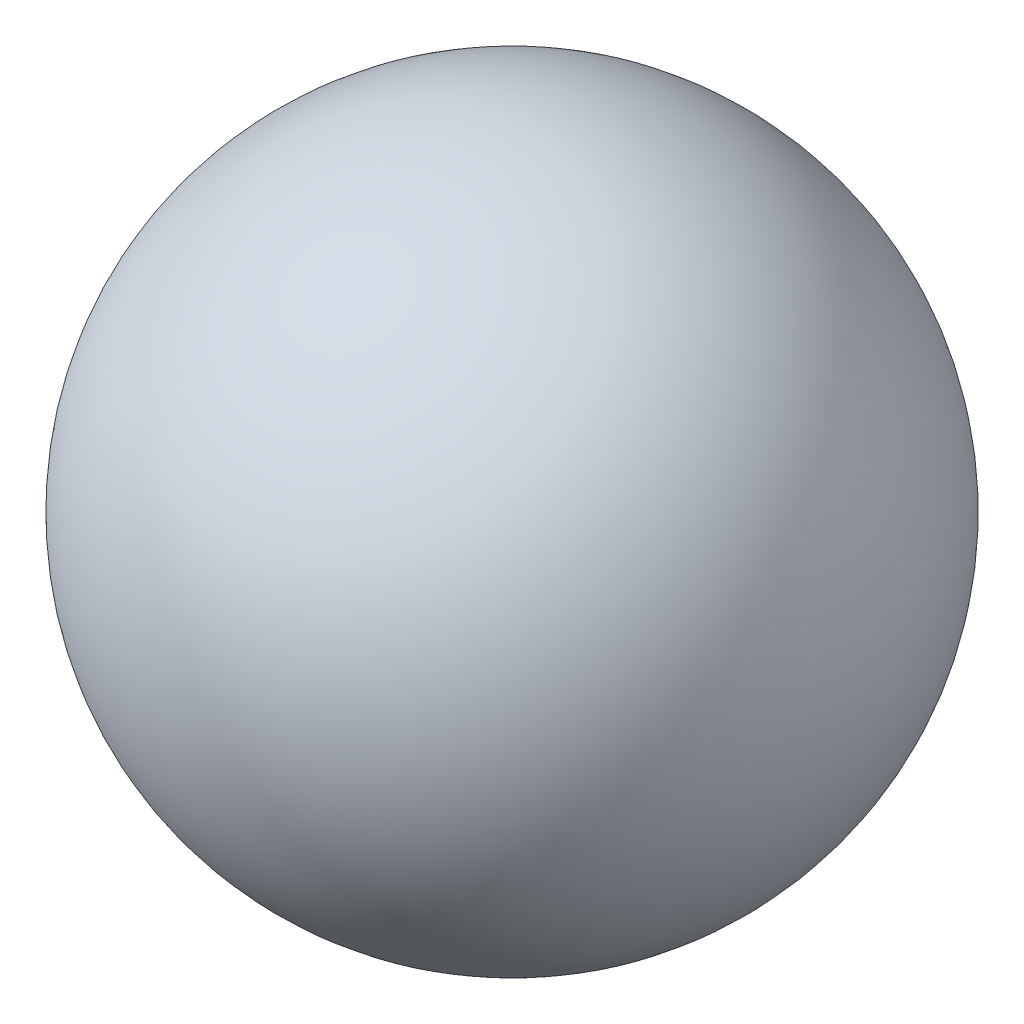
ISO-10303-21;
HEADER;
FILE_DESCRIPTION(('STEP AP214'),'2;1');
FILE_NAME('part.step','',(''),(''),'','','');
FILE_SCHEMA(('AUTOMOTIVE_DESIGN { 1 0 10303 214 1 1 1 1 }'));
ENDSEC;
DATA;
#1=APPLICATION_CONTEXT('core data for automotive mechanical design processes');
#2=APPLICATION_PROTOCOL_DEFINITION('international standard','automotive_design',2000,#1);
#3=PRODUCT_CONTEXT('',#1,'mechanical');
#4=PRODUCT('Part','Part','',(#3));
#5=PRODUCT_RELATED_PRODUCT_CATEGORY('part','',(#4));
#6=PRODUCT_DEFINITION_FORMATION('','',#4);
#7=PRODUCT_DEFINITION_CONTEXT('part definition',#1,'design');
#8=PRODUCT_DEFINITION('design','',#6,#7);
#9=PRODUCT_DEFINITION_SHAPE('','',#8);
#10=(LENGTH_UNIT() NAMED_UNIT(*) SI_UNIT(.MILLI.,.METRE.));
#11=(NAMED_UNIT(*) PLANE_ANGLE_UNIT() SI_UNIT($,.RADIAN.));
#12=(NAMED_UNIT(*) SI_UNIT($,.STERADIAN.) SOLID_ANGLE_UNIT());
#13=UNCERTAINTY_MEASURE_WITH_UNIT(LENGTH_MEASURE(1.E-05),#10,'distance_accuracy_value','');
#14=(GEOMETRIC_REPRESENTATION_CONTEXT(3) GLOBAL_UNCERTAINTY_ASSIGNED_CONTEXT((#13)) GLOBAL_UNIT_ASSIGNED_CONTEXT((#10,
#11,#12)) REPRESENTATION_CONTEXT('',''));
#15=CARTESIAN_POINT('',(0.,0.,0.));
#16=DIRECTION('',(0.,0.,1.));
#17=DIRECTION('',(1.,0.,0.));
#18=AXIS2_PLACEMENT_3D('',#15,#16,#17);
#19=CARTESIAN_POINT('',(-52.019276555044,45.9944163464973,0.));
#20=DIRECTION('',(0.,1.,0.));
#21=DIRECTION('',(1.,0.,0.));
#22=AXIS2_PLACEMENT_3D('',#19,#20,#21);
#23=SPHERICAL_SURFACE('',#22,6.75);
#24=CARTESIAN_POINT('',(-52.019276555044,52.7444163464973,0.));
#25=VERTEX_POINT('',#24);
#26=VERTEX_LOOP('',#25);
#27=FACE_BOUND('',#26,.T.);
#28=ADVANCED_FACE('F28',(#27),#23,.T.);
#29=CLOSED_SHELL('',(#28));
#30=MANIFOLD_SOLID_BREP('B2',#29);
#31=ADVANCED_BREP_SHAPE_REPRESENTATION('',(#18,#30),#14);
#32=SHAPE_DEFINITION_REPRESENTATION(#9,#31);
ENDSEC;
END-ISO-10303-21;
